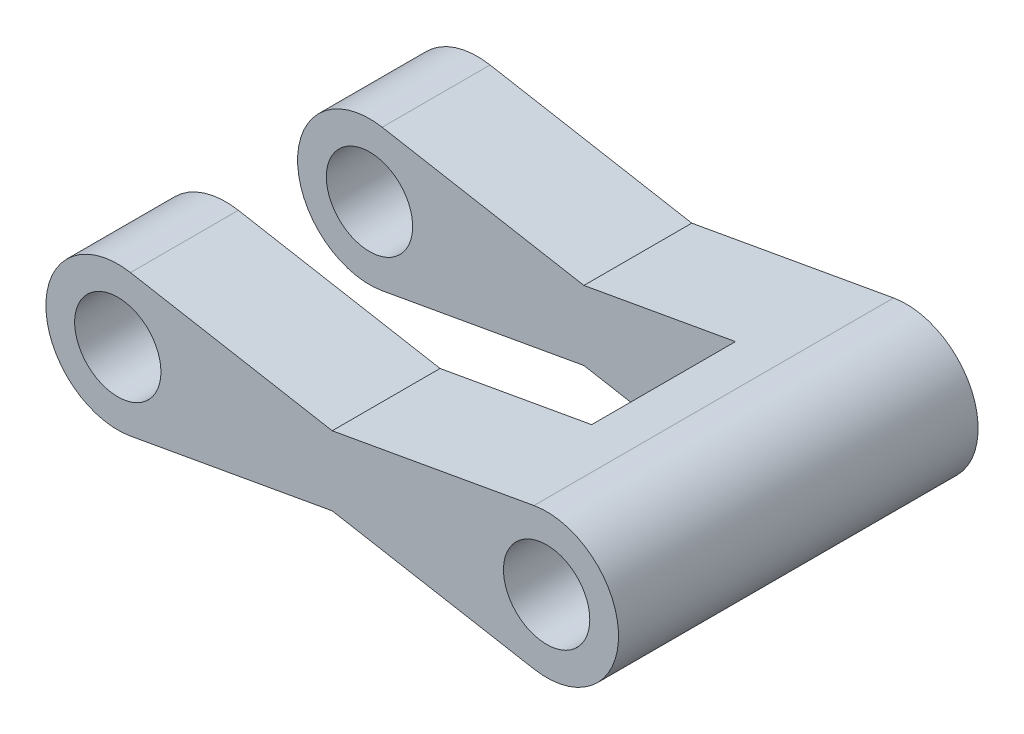
ISO-10303-21;
HEADER;
FILE_DESCRIPTION(('STEP AP214'),'2;1');
FILE_NAME('part.step','',(''),(''),'','','');
FILE_SCHEMA(('AUTOMOTIVE_DESIGN { 1 0 10303 214 1 1 1 1 }'));
ENDSEC;
DATA;
#1=APPLICATION_CONTEXT('core data for automotive mechanical design processes');
#2=APPLICATION_PROTOCOL_DEFINITION('international standard','automotive_design',2000,#1);
#3=PRODUCT_CONTEXT('',#1,'mechanical');
#4=PRODUCT('Part','Part','',(#3));
#5=PRODUCT_RELATED_PRODUCT_CATEGORY('part','',(#4));
#6=PRODUCT_DEFINITION_FORMATION('','',#4);
#7=PRODUCT_DEFINITION_CONTEXT('part definition',#1,'design');
#8=PRODUCT_DEFINITION('design','',#6,#7);
#9=PRODUCT_DEFINITION_SHAPE('','',#8);
#10=(LENGTH_UNIT() NAMED_UNIT(*) SI_UNIT(.MILLI.,.METRE.));
#11=(NAMED_UNIT(*) PLANE_ANGLE_UNIT() SI_UNIT($,.RADIAN.));
#12=(NAMED_UNIT(*) SI_UNIT($,.STERADIAN.) SOLID_ANGLE_UNIT());
#13=UNCERTAINTY_MEASURE_WITH_UNIT(LENGTH_MEASURE(1.E-05),#10,'distance_accuracy_value','');
#14=(GEOMETRIC_REPRESENTATION_CONTEXT(3) GLOBAL_UNCERTAINTY_ASSIGNED_CONTEXT((#13)) GLOBAL_UNIT_ASSIGNED_CONTEXT((#10,
#11,#12)) REPRESENTATION_CONTEXT('',''));
#15=CARTESIAN_POINT('',(0.,0.,0.));
#16=DIRECTION('',(0.,0.,1.));
#17=DIRECTION('',(1.,0.,0.));
#18=AXIS2_PLACEMENT_3D('',#15,#16,#17);
#19=CARTESIAN_POINT('',(-149.066301708992,0.,250.));
#20=DIRECTION('',(0.,0.,-1.));
#21=DIRECTION('',(-1.,0.,0.));
#22=AXIS2_PLACEMENT_3D('',#19,#20,#21);
#23=CYLINDRICAL_SURFACE('',#22,50.);
#24=CARTESIAN_POINT('',(-149.066301708992,0.,75.));
#25=DIRECTION('',(0.,0.,-1.));
#26=DIRECTION('',(-1.,0.,0.));
#27=AXIS2_PLACEMENT_3D('',#24,#25,#26);
#28=CIRCLE('',#27,50.);
#29=CARTESIAN_POINT('',(-140.258225287582,-49.218063653039,75.));
#30=VERTEX_POINT('',#29);
#31=CARTESIAN_POINT('',(-140.258225287582,49.218063653039,75.));
#32=VERTEX_POINT('',#31);
#33=EDGE_CURVE('E200',#30,#32,#28,.T.);
#34=ORIENTED_EDGE('',*,*,#33,.T.);
#35=DIRECTION('',(0.,0.,-1.));
#36=VECTOR('',#35,1.);
#37=CARTESIAN_POINT('',(-140.258225287582,49.218063653039,250.));
#38=LINE('',#37,#36);
#39=CARTESIAN_POINT('',(-140.258225287582,49.218063653039,0.));
#40=VERTEX_POINT('',#39);
#41=EDGE_CURVE('E86',#32,#40,#38,.T.);
#42=ORIENTED_EDGE('',*,*,#41,.T.);
#43=CARTESIAN_POINT('',(-149.066301708992,0.,0.));
#44=DIRECTION('',(0.,0.,1.));
#45=DIRECTION('',(1.,0.,0.));
#46=AXIS2_PLACEMENT_3D('',#43,#44,#45);
#47=CIRCLE('',#46,50.);
#48=CARTESIAN_POINT('',(-140.258225287582,-49.218063653039,0.));
#49=VERTEX_POINT('',#48);
#50=EDGE_CURVE('E146',#40,#49,#47,.T.);
#51=ORIENTED_EDGE('',*,*,#50,.T.);
#52=DIRECTION('',(0.,0.,-1.));
#53=VECTOR('',#52,1.);
#54=CARTESIAN_POINT('',(-140.258225287582,-49.218063653039,250.));
#55=LINE('',#54,#53);
#56=EDGE_CURVE('E172',#30,#49,#55,.T.);
#57=ORIENTED_EDGE('',*,*,#56,.F.);
#58=EDGE_LOOP('',(#34,#42,#51,#57));
#59=FACE_BOUND('',#58,.T.);
#60=ADVANCED_FACE('F34',(#59),#23,.T.);
#61=CARTESIAN_POINT('',(4.18211915753357,-23.3689851282114,250.));
#62=DIRECTION('',(-0.176161528428201,0.98436127306078,0.));
#63=DIRECTION('',(-0.98436127306078,-0.176161528428201,0.));
#64=AXIS2_PLACEMENT_3D('',#61,#62,#63);
#65=PLANE('',#64);
#66=DIRECTION('',(0.,0.,-1.));
#67=VECTOR('',#66,1.);
#68=CARTESIAN_POINT('',(0.,-24.1174181710608,250.));
#69=LINE('',#68,#67);
#70=CARTESIAN_POINT('',(0.,-24.1174181710608,75.));
#71=VERTEX_POINT('',#70);
#72=CARTESIAN_POINT('',(0.,-24.1174181710608,0.));
#73=VERTEX_POINT('',#72);
#74=EDGE_CURVE('E168',#71,#73,#69,.T.);
#75=ORIENTED_EDGE('',*,*,#74,.F.);
#76=DIRECTION('',(-0.98436127306078,-0.176161528428201,0.));
#77=VECTOR('',#76,1.);
#78=CARTESIAN_POINT('',(4.18211915753357,-23.3689851282114,75.));
#79=LINE('',#78,#77);
#80=EDGE_CURVE('E202',#71,#30,#79,.T.);
#81=ORIENTED_EDGE('',*,*,#80,.T.);
#82=ORIENTED_EDGE('',*,*,#56,.T.);
#83=DIRECTION('',(0.98436127306078,0.176161528428201,0.));
#84=VECTOR('',#83,1.);
#85=CARTESIAN_POINT('',(4.18211915753357,-23.3689851282114,0.));
#86=LINE('',#85,#84);
#87=EDGE_CURVE('E149',#49,#73,#86,.T.);
#88=ORIENTED_EDGE('',*,*,#87,.T.);
#89=EDGE_LOOP('',(#75,#81,#82,#88));
#90=FACE_BOUND('',#89,.T.);
#91=ADVANCED_FACE('F271',(#90),#65,.F.);
#92=CARTESIAN_POINT('',(4.18211915753357,23.3689851282114,250.));
#93=DIRECTION('',(0.176161528428201,0.98436127306078,0.));
#94=DIRECTION('',(-0.98436127306078,0.176161528428201,0.));
#95=AXIS2_PLACEMENT_3D('',#92,#93,#94);
#96=PLANE('',#95);
#97=DIRECTION('',(-0.98436127306078,0.176161528428201,0.));
#98=VECTOR('',#97,1.);
#99=CARTESIAN_POINT('',(4.18211915753357,23.3689851282114,75.));
#100=LINE('',#99,#98);
#101=CARTESIAN_POINT('',(0.,24.1174181710608,75.));
#102=VERTEX_POINT('',#101);
#103=EDGE_CURVE('E180',#102,#32,#100,.T.);
#104=ORIENTED_EDGE('',*,*,#103,.F.);
#105=DIRECTION('',(0.,0.,-1.));
#106=VECTOR('',#105,1.);
#107=CARTESIAN_POINT('',(0.,24.1174181710608,250.));
#108=LINE('',#107,#106);
#109=CARTESIAN_POINT('',(0.,24.1174181710608,0.));
#110=VERTEX_POINT('',#109);
#111=EDGE_CURVE('E165',#102,#110,#108,.T.);
#112=ORIENTED_EDGE('',*,*,#111,.T.);
#113=DIRECTION('',(0.98436127306078,-0.176161528428201,0.));
#114=VECTOR('',#113,1.);
#115=CARTESIAN_POINT('',(4.18211915753357,23.3689851282114,0.));
#116=LINE('',#115,#114);
#117=EDGE_CURVE('E157',#40,#110,#116,.T.);
#118=ORIENTED_EDGE('',*,*,#117,.F.);
#119=ORIENTED_EDGE('',*,*,#41,.F.);
#120=EDGE_LOOP('',(#104,#112,#118,#119));
#121=FACE_BOUND('',#120,.T.);
#122=ADVANCED_FACE('F231',(#121),#96,.T.);
#123=CARTESIAN_POINT('',(-149.066301708992,0.,250.));
#124=DIRECTION('',(0.,0.,-1.));
#125=DIRECTION('',(-1.,0.,0.));
#126=AXIS2_PLACEMENT_3D('',#123,#124,#125);
#127=CYLINDRICAL_SURFACE('',#126,30.);
#128=CARTESIAN_POINT('',(-149.066301708992,0.,75.));
#129=DIRECTION('',(0.,0.,-1.));
#130=DIRECTION('',(-1.,0.,0.));
#131=AXIS2_PLACEMENT_3D('',#128,#129,#130);
#132=CIRCLE('',#131,30.);
#133=CARTESIAN_POINT('',(-179.066301708992,0.,75.));
#134=VERTEX_POINT('',#133);
#135=EDGE_CURVE('E178',#134,#134,#132,.T.);
#136=ORIENTED_EDGE('',*,*,#135,.F.);
#137=EDGE_LOOP('',(#136));
#138=FACE_BOUND('',#137,.T.);
#139=CARTESIAN_POINT('',(-149.066301708992,0.,0.));
#140=DIRECTION('',(0.,0.,1.));
#141=DIRECTION('',(1.,0.,0.));
#142=AXIS2_PLACEMENT_3D('',#139,#140,#141);
#143=CIRCLE('',#142,30.);
#144=CARTESIAN_POINT('',(-119.066301708992,0.,0.));
#145=VERTEX_POINT('',#144);
#146=EDGE_CURVE('E143',#145,#145,#143,.T.);
#147=ORIENTED_EDGE('',*,*,#146,.F.);
#148=EDGE_LOOP('',(#147));
#149=FACE_BOUND('',#148,.T.);
#150=ADVANCED_FACE('F278',(#138,#149),#127,.F.);
#151=CARTESIAN_POINT('',(-149.066301708992,0.,175.));
#152=DIRECTION('',(0.,0.,1.));
#153=DIRECTION('',(1.,0.,0.));
#154=AXIS2_PLACEMENT_3D('',#151,#152,#153);
#155=CIRCLE('',#154,50.);
#156=CARTESIAN_POINT('',(-140.258225287582,49.218063653039,175.));
#157=VERTEX_POINT('',#156);
#158=CARTESIAN_POINT('',(-140.258225287582,-49.218063653039,175.));
#159=VERTEX_POINT('',#158);
#160=EDGE_CURVE('E49',#157,#159,#155,.T.);
#161=ORIENTED_EDGE('',*,*,#160,.T.);
#162=CARTESIAN_POINT('',(-140.258225287582,-49.218063653039,250.));
#163=VERTEX_POINT('',#162);
#164=EDGE_CURVE('E42',#163,#159,#55,.T.);
#165=ORIENTED_EDGE('',*,*,#164,.F.);
#166=CARTESIAN_POINT('',(-149.066301708992,0.,250.));
#167=DIRECTION('',(0.,0.,1.));
#168=DIRECTION('',(1.,0.,0.));
#169=AXIS2_PLACEMENT_3D('',#166,#167,#168);
#170=CIRCLE('',#169,50.);
#171=CARTESIAN_POINT('',(-140.258225287582,49.218063653039,250.));
#172=VERTEX_POINT('',#171);
#173=EDGE_CURVE('E211',#172,#163,#170,.T.);
#174=ORIENTED_EDGE('',*,*,#173,.F.);
#175=EDGE_CURVE('E57',#172,#157,#38,.T.);
#176=ORIENTED_EDGE('',*,*,#175,.T.);
#177=EDGE_LOOP('',(#161,#165,#174,#176));
#178=FACE_BOUND('',#177,.T.);
#179=ADVANCED_FACE('F267',(#178),#23,.T.);
#180=ORIENTED_EDGE('',*,*,#164,.T.);
#181=DIRECTION('',(0.98436127306078,0.176161528428201,0.));
#182=VECTOR('',#181,1.);
#183=CARTESIAN_POINT('',(4.18211915753356,-23.3689851282114,175.));
#184=LINE('',#183,#182);
#185=CARTESIAN_POINT('',(0.,-24.1174181710608,175.));
#186=VERTEX_POINT('',#185);
#187=EDGE_CURVE('E188',#159,#186,#184,.T.);
#188=ORIENTED_EDGE('',*,*,#187,.T.);
#189=CARTESIAN_POINT('',(0.,-24.1174181710608,250.));
#190=VERTEX_POINT('',#189);
#191=EDGE_CURVE('E169',#190,#186,#69,.T.);
#192=ORIENTED_EDGE('',*,*,#191,.F.);
#193=DIRECTION('',(0.98436127306078,0.176161528428201,0.));
#194=VECTOR('',#193,1.);
#195=CARTESIAN_POINT('',(4.18211915753357,-23.3689851282114,250.));
#196=LINE('',#195,#194);
#197=EDGE_CURVE('E95',#163,#190,#196,.T.);
#198=ORIENTED_EDGE('',*,*,#197,.F.);
#199=EDGE_LOOP('',(#180,#188,#192,#198));
#200=FACE_BOUND('',#199,.T.);
#201=ADVANCED_FACE('F214',(#200),#65,.F.);
#202=CARTESIAN_POINT('',(-4.18211915753357,-23.3689851282114,250.));
#203=DIRECTION('',(0.176161528428201,0.98436127306078,0.));
#204=DIRECTION('',(-0.98436127306078,0.176161528428201,0.));
#205=AXIS2_PLACEMENT_3D('',#202,#203,#204);
#206=PLANE('',#205);
#207=DIRECTION('',(0.,0.,-1.));
#208=VECTOR('',#207,1.);
#209=CARTESIAN_POINT('',(105.363390815612,-42.9732757453255,250.));
#210=LINE('',#209,#208);
#211=CARTESIAN_POINT('',(105.363390815612,-42.9732757453255,175.));
#212=VERTEX_POINT('',#211);
#213=CARTESIAN_POINT('',(105.363390815611,-42.9732757453255,75.));
#214=VERTEX_POINT('',#213);
#215=EDGE_CURVE('E147',#212,#214,#210,.T.);
#216=ORIENTED_EDGE('',*,*,#215,.T.);
#217=DIRECTION('',(-0.98436127306078,0.176161528428201,0.));
#218=VECTOR('',#217,1.);
#219=CARTESIAN_POINT('',(-4.18211915753357,-23.3689851282114,75.));
#220=LINE('',#219,#218);
#221=EDGE_CURVE('E205',#214,#71,#220,.T.);
#222=ORIENTED_EDGE('',*,*,#221,.T.);
#223=ORIENTED_EDGE('',*,*,#74,.T.);
#224=DIRECTION('',(0.98436127306078,-0.176161528428201,0.));
#225=VECTOR('',#224,1.);
#226=CARTESIAN_POINT('',(-4.18211915753357,-23.3689851282114,0.));
#227=LINE('',#226,#225);
#228=CARTESIAN_POINT('',(140.258225287582,-49.218063653039,0.));
#229=VERTEX_POINT('',#228);
#230=EDGE_CURVE('E152',#73,#229,#227,.T.);
#231=ORIENTED_EDGE('',*,*,#230,.T.);
#232=DIRECTION('',(0.,0.,-1.));
#233=VECTOR('',#232,1.);
#234=CARTESIAN_POINT('',(140.258225287582,-49.218063653039,250.));
#235=LINE('',#234,#233);
#236=CARTESIAN_POINT('',(140.258225287582,-49.218063653039,250.));
#237=VERTEX_POINT('',#236);
#238=EDGE_CURVE('E128',#237,#229,#235,.T.);
#239=ORIENTED_EDGE('',*,*,#238,.F.);
#240=DIRECTION('',(0.98436127306078,-0.176161528428201,0.));
#241=VECTOR('',#240,1.);
#242=CARTESIAN_POINT('',(-4.18211915753357,-23.3689851282114,250.));
#243=LINE('',#242,#241);
#244=EDGE_CURVE('E115',#190,#237,#243,.T.);
#245=ORIENTED_EDGE('',*,*,#244,.F.);
#246=ORIENTED_EDGE('',*,*,#191,.T.);
#247=DIRECTION('',(0.98436127306078,-0.176161528428201,0.));
#248=VECTOR('',#247,1.);
#249=CARTESIAN_POINT('',(-4.18211915753357,-23.3689851282114,175.));
#250=LINE('',#249,#248);
#251=EDGE_CURVE('E181',#186,#212,#250,.T.);
#252=ORIENTED_EDGE('',*,*,#251,.T.);
#253=EDGE_LOOP('',(#216,#222,#223,#231,#239,#245,#246,#252));
#254=FACE_BOUND('',#253,.T.);
#255=ADVANCED_FACE('F216',(#254),#206,.F.);
#256=CARTESIAN_POINT('',(149.066301708992,0.,250.));
#257=DIRECTION('',(0.,0.,-1.));
#258=DIRECTION('',(-1.,0.,0.));
#259=AXIS2_PLACEMENT_3D('',#256,#257,#258);
#260=CYLINDRICAL_SURFACE('',#259,50.);
#261=CARTESIAN_POINT('',(149.066301708992,0.,0.));
#262=DIRECTION('',(0.,0.,1.));
#263=DIRECTION('',(1.,0.,0.));
#264=AXIS2_PLACEMENT_3D('',#261,#262,#263);
#265=CIRCLE('',#264,50.);
#266=CARTESIAN_POINT('',(140.258225287582,49.218063653039,0.));
#267=VERTEX_POINT('',#266);
#268=EDGE_CURVE('E124',#229,#267,#265,.T.);
#269=ORIENTED_EDGE('',*,*,#268,.T.);
#270=DIRECTION('',(0.,0.,-1.));
#271=VECTOR('',#270,1.);
#272=CARTESIAN_POINT('',(140.258225287582,49.218063653039,250.));
#273=LINE('',#272,#271);
#274=CARTESIAN_POINT('',(140.258225287582,49.218063653039,250.));
#275=VERTEX_POINT('',#274);
#276=EDGE_CURVE('E121',#275,#267,#273,.T.);
#277=ORIENTED_EDGE('',*,*,#276,.F.);
#278=CARTESIAN_POINT('',(149.066301708992,0.,250.));
#279=DIRECTION('',(0.,0.,1.));
#280=DIRECTION('',(1.,0.,0.));
#281=AXIS2_PLACEMENT_3D('',#278,#279,#280);
#282=CIRCLE('',#281,50.);
#283=EDGE_CURVE('E107',#237,#275,#282,.T.);
#284=ORIENTED_EDGE('',*,*,#283,.F.);
#285=ORIENTED_EDGE('',*,*,#238,.T.);
#286=EDGE_LOOP('',(#269,#277,#284,#285));
#287=FACE_BOUND('',#286,.T.);
#288=ADVANCED_FACE('F122',(#287),#260,.T.);
#289=CARTESIAN_POINT('',(-4.18211915753357,23.3689851282114,250.));
#290=DIRECTION('',(-0.176161528428201,0.98436127306078,0.));
#291=DIRECTION('',(-0.98436127306078,-0.176161528428201,0.));
#292=AXIS2_PLACEMENT_3D('',#289,#290,#291);
#293=PLANE('',#292);
#294=DIRECTION('',(-0.98436127306078,-0.176161528428201,0.));
#295=VECTOR('',#294,1.);
#296=CARTESIAN_POINT('',(-4.18211915753357,23.3689851282114,75.));
#297=LINE('',#296,#295);
#298=CARTESIAN_POINT('',(105.363390815611,42.9732757453255,75.));
#299=VERTEX_POINT('',#298);
#300=EDGE_CURVE('E185',#299,#102,#297,.T.);
#301=ORIENTED_EDGE('',*,*,#300,.F.);
#302=DIRECTION('',(0.,0.,-1.));
#303=VECTOR('',#302,1.);
#304=CARTESIAN_POINT('',(105.363390815612,42.9732757453255,250.));
#305=LINE('',#304,#303);
#306=CARTESIAN_POINT('',(105.363390815612,42.9732757453255,175.));
#307=VERTEX_POINT('',#306);
#308=EDGE_CURVE('E11',#307,#299,#305,.T.);
#309=ORIENTED_EDGE('',*,*,#308,.F.);
#310=DIRECTION('',(0.98436127306078,0.176161528428201,0.));
#311=VECTOR('',#310,1.);
#312=CARTESIAN_POINT('',(-4.18211915753357,23.3689851282114,175.));
#313=LINE('',#312,#311);
#314=CARTESIAN_POINT('',(0.,24.1174181710608,175.));
#315=VERTEX_POINT('',#314);
#316=EDGE_CURVE('E261',#315,#307,#313,.T.);
#317=ORIENTED_EDGE('',*,*,#316,.F.);
#318=CARTESIAN_POINT('',(0.,24.1174181710608,250.));
#319=VERTEX_POINT('',#318);
#320=EDGE_CURVE('E129',#319,#315,#108,.T.);
#321=ORIENTED_EDGE('',*,*,#320,.F.);
#322=DIRECTION('',(0.98436127306078,0.176161528428201,0.));
#323=VECTOR('',#322,1.);
#324=CARTESIAN_POINT('',(-4.18211915753357,23.3689851282114,250.));
#325=LINE('',#324,#323);
#326=EDGE_CURVE('E113',#319,#275,#325,.T.);
#327=ORIENTED_EDGE('',*,*,#326,.T.);
#328=ORIENTED_EDGE('',*,*,#276,.T.);
#329=DIRECTION('',(0.98436127306078,0.176161528428201,0.));
#330=VECTOR('',#329,1.);
#331=CARTESIAN_POINT('',(-4.18211915753357,23.3689851282114,0.));
#332=LINE('',#331,#330);
#333=EDGE_CURVE('E155',#110,#267,#332,.T.);
#334=ORIENTED_EDGE('',*,*,#333,.F.);
#335=ORIENTED_EDGE('',*,*,#111,.F.);
#336=EDGE_LOOP('',(#301,#309,#317,#321,#327,#328,#334,#335));
#337=FACE_BOUND('',#336,.T.);
#338=ADVANCED_FACE('F132',(#337),#293,.T.);
#339=DIRECTION('',(0.98436127306078,-0.176161528428201,0.));
#340=VECTOR('',#339,1.);
#341=CARTESIAN_POINT('',(4.18211915753356,23.3689851282114,175.));
#342=LINE('',#341,#340);
#343=EDGE_CURVE('E176',#157,#315,#342,.T.);
#344=ORIENTED_EDGE('',*,*,#343,.F.);
#345=ORIENTED_EDGE('',*,*,#175,.F.);
#346=DIRECTION('',(0.98436127306078,-0.176161528428201,0.));
#347=VECTOR('',#346,1.);
#348=CARTESIAN_POINT('',(4.18211915753357,23.3689851282114,250.));
#349=LINE('',#348,#347);
#350=EDGE_CURVE('E135',#172,#319,#349,.T.);
#351=ORIENTED_EDGE('',*,*,#350,.T.);
#352=ORIENTED_EDGE('',*,*,#320,.T.);
#353=EDGE_LOOP('',(#344,#345,#351,#352));
#354=FACE_BOUND('',#353,.T.);
#355=ADVANCED_FACE('F268',(#354),#96,.T.);
#356=CARTESIAN_POINT('',(-149.066301708992,0.,175.));
#357=DIRECTION('',(0.,0.,1.));
#358=DIRECTION('',(1.,0.,0.));
#359=AXIS2_PLACEMENT_3D('',#356,#357,#358);
#360=CIRCLE('',#359,30.);
#361=CARTESIAN_POINT('',(-119.066301708992,0.,175.));
#362=VERTEX_POINT('',#361);
#363=EDGE_CURVE('E174',#362,#362,#360,.T.);
#364=ORIENTED_EDGE('',*,*,#363,.F.);
#365=EDGE_LOOP('',(#364));
#366=FACE_BOUND('',#365,.T.);
#367=CARTESIAN_POINT('',(-149.066301708992,0.,250.));
#368=DIRECTION('',(0.,0.,1.));
#369=DIRECTION('',(1.,0.,0.));
#370=AXIS2_PLACEMENT_3D('',#367,#368,#369);
#371=CIRCLE('',#370,30.);
#372=CARTESIAN_POINT('',(-119.066301708992,0.,250.));
#373=VERTEX_POINT('',#372);
#374=EDGE_CURVE('E163',#373,#373,#371,.T.);
#375=ORIENTED_EDGE('',*,*,#374,.T.);
#376=EDGE_LOOP('',(#375));
#377=FACE_BOUND('',#376,.T.);
#378=ADVANCED_FACE('F36',(#366,#377),#127,.F.);
#379=CARTESIAN_POINT('',(149.066301708992,0.,250.));
#380=DIRECTION('',(0.,0.,-1.));
#381=DIRECTION('',(-1.,0.,0.));
#382=AXIS2_PLACEMENT_3D('',#379,#380,#381);
#383=CYLINDRICAL_SURFACE('',#382,30.);
#384=CARTESIAN_POINT('',(149.066301708992,0.,250.));
#385=DIRECTION('',(0.,0.,1.));
#386=DIRECTION('',(1.,0.,0.));
#387=AXIS2_PLACEMENT_3D('',#384,#385,#386);
#388=CIRCLE('',#387,30.);
#389=CARTESIAN_POINT('',(179.066301708992,0.,250.));
#390=VERTEX_POINT('',#389);
#391=EDGE_CURVE('E137',#390,#390,#388,.T.);
#392=ORIENTED_EDGE('',*,*,#391,.T.);
#393=EDGE_LOOP('',(#392));
#394=FACE_BOUND('',#393,.T.);
#395=CARTESIAN_POINT('',(149.066301708992,0.,0.));
#396=DIRECTION('',(0.,0.,1.));
#397=DIRECTION('',(1.,0.,0.));
#398=AXIS2_PLACEMENT_3D('',#395,#396,#397);
#399=CIRCLE('',#398,30.);
#400=CARTESIAN_POINT('',(179.066301708992,0.,0.));
#401=VERTEX_POINT('',#400);
#402=EDGE_CURVE('E160',#401,#401,#399,.T.);
#403=ORIENTED_EDGE('',*,*,#402,.F.);
#404=EDGE_LOOP('',(#403));
#405=FACE_BOUND('',#404,.T.);
#406=ADVANCED_FACE('F290',(#394,#405),#383,.F.);
#407=CARTESIAN_POINT('',(0.,0.,250.));
#408=DIRECTION('',(0.,0.,1.));
#409=DIRECTION('',(1.,0.,0.));
#410=AXIS2_PLACEMENT_3D('',#407,#408,#409);
#411=PLANE('',#410);
#412=ORIENTED_EDGE('',*,*,#374,.F.);
#413=EDGE_LOOP('',(#412));
#414=FACE_BOUND('',#413,.T.);
#415=ORIENTED_EDGE('',*,*,#173,.T.);
#416=ORIENTED_EDGE('',*,*,#197,.T.);
#417=ORIENTED_EDGE('',*,*,#244,.T.);
#418=ORIENTED_EDGE('',*,*,#283,.T.);
#419=ORIENTED_EDGE('',*,*,#326,.F.);
#420=ORIENTED_EDGE('',*,*,#350,.F.);
#421=EDGE_LOOP('',(#415,#416,#417,#418,#419,#420));
#422=FACE_BOUND('',#421,.T.);
#423=ORIENTED_EDGE('',*,*,#391,.F.);
#424=EDGE_LOOP('',(#423));
#425=FACE_BOUND('',#424,.T.);
#426=ADVANCED_FACE('F109',(#414,#422,#425),#411,.T.);
#427=CARTESIAN_POINT('',(0.,0.,0.));
#428=DIRECTION('',(0.,0.,1.));
#429=DIRECTION('',(1.,0.,0.));
#430=AXIS2_PLACEMENT_3D('',#427,#428,#429);
#431=PLANE('',#430);
#432=ORIENTED_EDGE('',*,*,#146,.T.);
#433=EDGE_LOOP('',(#432));
#434=FACE_BOUND('',#433,.T.);
#435=ORIENTED_EDGE('',*,*,#50,.F.);
#436=ORIENTED_EDGE('',*,*,#117,.T.);
#437=ORIENTED_EDGE('',*,*,#333,.T.);
#438=ORIENTED_EDGE('',*,*,#268,.F.);
#439=ORIENTED_EDGE('',*,*,#230,.F.);
#440=ORIENTED_EDGE('',*,*,#87,.F.);
#441=EDGE_LOOP('',(#435,#436,#437,#438,#439,#440));
#442=FACE_BOUND('',#441,.T.);
#443=ORIENTED_EDGE('',*,*,#402,.T.);
#444=EDGE_LOOP('',(#443));
#445=FACE_BOUND('',#444,.T.);
#446=ADVANCED_FACE('F219',(#434,#442,#445),#431,.F.);
#447=CARTESIAN_POINT('',(105.363390815611,-125.,75.));
#448=DIRECTION('',(1.,0.,0.));
#449=DIRECTION('',(0.,0.,-1.));
#450=AXIS2_PLACEMENT_3D('',#447,#448,#449);
#451=PLANE('',#450);
#452=DIRECTION('',(0.,1.,0.));
#453=VECTOR('',#452,1.);
#454=CARTESIAN_POINT('',(105.363390815612,-125.,175.));
#455=LINE('',#454,#453);
#456=EDGE_CURVE('E259',#212,#307,#455,.T.);
#457=ORIENTED_EDGE('',*,*,#456,.T.);
#458=ORIENTED_EDGE('',*,*,#308,.T.);
#459=DIRECTION('',(0.,1.,0.));
#460=VECTOR('',#459,1.);
#461=CARTESIAN_POINT('',(105.363390815611,-125.,75.));
#462=LINE('',#461,#460);
#463=EDGE_CURVE('E177',#214,#299,#462,.T.);
#464=ORIENTED_EDGE('',*,*,#463,.F.);
#465=ORIENTED_EDGE('',*,*,#215,.F.);
#466=EDGE_LOOP('',(#457,#458,#464,#465));
#467=FACE_BOUND('',#466,.T.);
#468=ADVANCED_FACE('F258',(#467),#451,.F.);
#469=CARTESIAN_POINT('',(-199.066301708992,-125.,75.));
#470=DIRECTION('',(0.,0.,-1.));
#471=DIRECTION('',(-1.,0.,0.));
#472=AXIS2_PLACEMENT_3D('',#469,#470,#471);
#473=PLANE('',#472);
#474=ORIENTED_EDGE('',*,*,#135,.T.);
#475=EDGE_LOOP('',(#474));
#476=FACE_BOUND('',#475,.T.);
#477=ORIENTED_EDGE('',*,*,#463,.T.);
#478=ORIENTED_EDGE('',*,*,#300,.T.);
#479=ORIENTED_EDGE('',*,*,#103,.T.);
#480=ORIENTED_EDGE('',*,*,#33,.F.);
#481=ORIENTED_EDGE('',*,*,#80,.F.);
#482=ORIENTED_EDGE('',*,*,#221,.F.);
#483=EDGE_LOOP('',(#477,#478,#479,#480,#481,#482));
#484=FACE_BOUND('',#483,.T.);
#485=ADVANCED_FACE('F235',(#476,#484),#473,.F.);
#486=CARTESIAN_POINT('',(105.363390815612,-125.,175.));
#487=DIRECTION('',(0.,0.,1.));
#488=DIRECTION('',(1.,0.,0.));
#489=AXIS2_PLACEMENT_3D('',#486,#487,#488);
#490=PLANE('',#489);
#491=ORIENTED_EDGE('',*,*,#363,.T.);
#492=EDGE_LOOP('',(#491));
#493=FACE_BOUND('',#492,.T.);
#494=ORIENTED_EDGE('',*,*,#187,.F.);
#495=ORIENTED_EDGE('',*,*,#160,.F.);
#496=ORIENTED_EDGE('',*,*,#343,.T.);
#497=ORIENTED_EDGE('',*,*,#316,.T.);
#498=ORIENTED_EDGE('',*,*,#456,.F.);
#499=ORIENTED_EDGE('',*,*,#251,.F.);
#500=EDGE_LOOP('',(#494,#495,#496,#497,#498,#499));
#501=FACE_BOUND('',#500,.T.);
#502=ADVANCED_FACE('F260',(#493,#501),#490,.F.);
#503=CLOSED_SHELL('',(#60,#91,#122,#150,#179,#201,#255,#288,#338,#355,#378,#406,#426,#446,#468,
#485,#502));
#504=MANIFOLD_SOLID_BREP('B2',#503);
#505=ADVANCED_BREP_SHAPE_REPRESENTATION('',(#18,#504),#14);
#506=SHAPE_DEFINITION_REPRESENTATION(#9,#505);
ENDSEC;
END-ISO-10303-21;
